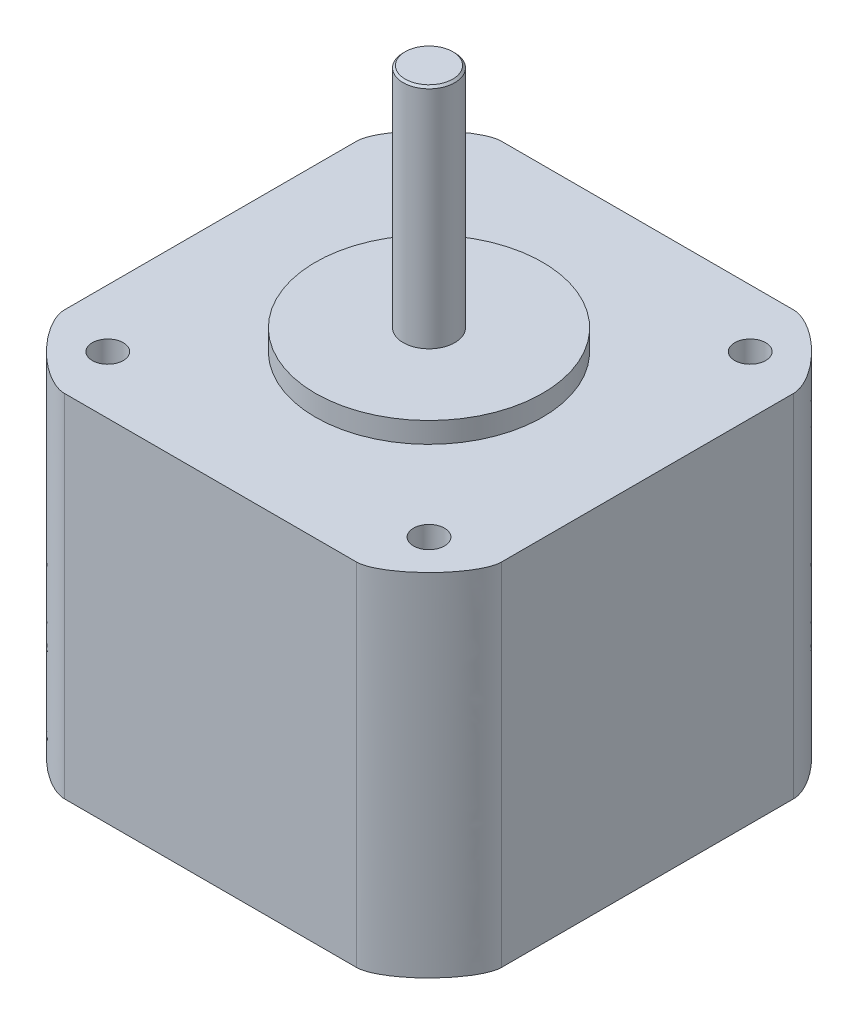
ISO-10303-21;
HEADER;
FILE_DESCRIPTION(('STEP AP214'),'2;1');
FILE_NAME('part.step','',(''),(''),'','','');
FILE_SCHEMA(('AUTOMOTIVE_DESIGN { 1 0 10303 214 1 1 1 1 }'));
ENDSEC;
DATA;
#1=APPLICATION_CONTEXT('core data for automotive mechanical design processes');
#2=APPLICATION_PROTOCOL_DEFINITION('international standard','automotive_design',2000,#1);
#3=PRODUCT_CONTEXT('',#1,'mechanical');
#4=PRODUCT('Part','Part','',(#3));
#5=PRODUCT_RELATED_PRODUCT_CATEGORY('part','',(#4));
#6=PRODUCT_DEFINITION_FORMATION('','',#4);
#7=PRODUCT_DEFINITION_CONTEXT('part definition',#1,'design');
#8=PRODUCT_DEFINITION('design','',#6,#7);
#9=PRODUCT_DEFINITION_SHAPE('','',#8);
#10=(LENGTH_UNIT() NAMED_UNIT(*) SI_UNIT(.MILLI.,.METRE.));
#11=(NAMED_UNIT(*) PLANE_ANGLE_UNIT() SI_UNIT($,.RADIAN.));
#12=(NAMED_UNIT(*) SI_UNIT($,.STERADIAN.) SOLID_ANGLE_UNIT());
#13=UNCERTAINTY_MEASURE_WITH_UNIT(LENGTH_MEASURE(1.E-05),#10,'distance_accuracy_value','');
#14=(GEOMETRIC_REPRESENTATION_CONTEXT(3) GLOBAL_UNCERTAINTY_ASSIGNED_CONTEXT((#13)) GLOBAL_UNIT_ASSIGNED_CONTEXT((#10,
#11,#12)) REPRESENTATION_CONTEXT('',''));
#15=CARTESIAN_POINT('',(0.,0.,0.));
#16=DIRECTION('',(0.,0.,1.));
#17=DIRECTION('',(1.,0.,0.));
#18=AXIS2_PLACEMENT_3D('',#15,#16,#17);
#19=CARTESIAN_POINT('',(0.,0.,0.));
#20=DIRECTION('',(0.,1.,0.));
#21=DIRECTION('',(0.,0.,1.));
#22=AXIS2_PLACEMENT_3D('',#19,#20,#21);
#23=PLANE('',#22);
#24=CARTESIAN_POINT('',(15.55,0.,15.55));
#25=DIRECTION('',(0.,1.,0.));
#26=DIRECTION('',(0.,0.,1.));
#27=AXIS2_PLACEMENT_3D('',#24,#25,#26);
#28=CIRCLE('',#27,1.5);
#29=CARTESIAN_POINT('',(15.55,0.,17.05));
#30=VERTEX_POINT('',#29);
#31=EDGE_CURVE('E704',#30,#30,#28,.T.);
#32=ORIENTED_EDGE('',*,*,#31,.F.);
#33=EDGE_LOOP('',(#32));
#34=FACE_BOUND('',#33,.T.);
#35=CARTESIAN_POINT('',(15.55,0.,-15.55));
#36=DIRECTION('',(0.,1.,0.));
#37=DIRECTION('',(0.,0.,1.));
#38=AXIS2_PLACEMENT_3D('',#35,#36,#37);
#39=CIRCLE('',#38,1.5);
#40=CARTESIAN_POINT('',(15.55,0.,-14.05));
#41=VERTEX_POINT('',#40);
#42=EDGE_CURVE('E709',#41,#41,#39,.T.);
#43=ORIENTED_EDGE('',*,*,#42,.F.);
#44=EDGE_LOOP('',(#43));
#45=FACE_BOUND('',#44,.T.);
#46=CARTESIAN_POINT('',(-15.55,0.,-15.55));
#47=DIRECTION('',(0.,1.,0.));
#48=DIRECTION('',(0.,0.,1.));
#49=AXIS2_PLACEMENT_3D('',#46,#47,#48);
#50=CIRCLE('',#49,1.5);
#51=CARTESIAN_POINT('',(-15.55,0.,-14.05));
#52=VERTEX_POINT('',#51);
#53=EDGE_CURVE('E715',#52,#52,#50,.T.);
#54=ORIENTED_EDGE('',*,*,#53,.F.);
#55=EDGE_LOOP('',(#54));
#56=FACE_BOUND('',#55,.T.);
#57=CARTESIAN_POINT('',(-15.55,0.,15.55));
#58=DIRECTION('',(0.,1.,0.));
#59=DIRECTION('',(0.,0.,1.));
#60=AXIS2_PLACEMENT_3D('',#57,#58,#59);
#61=CIRCLE('',#60,1.5);
#62=CARTESIAN_POINT('',(-15.55,0.,17.05));
#63=VERTEX_POINT('',#62);
#64=EDGE_CURVE('E721',#63,#63,#61,.T.);
#65=ORIENTED_EDGE('',*,*,#64,.F.);
#66=EDGE_LOOP('',(#65));
#67=FACE_BOUND('',#66,.T.);
#68=DIRECTION('',(1.,0.,0.));
#69=VECTOR('',#68,1.);
#70=CARTESIAN_POINT('',(0.,0.,21.15));
#71=LINE('',#70,#69);
#72=CARTESIAN_POINT('',(-14.15,0.,21.15));
#73=VERTEX_POINT('',#72);
#74=CARTESIAN_POINT('',(14.15,0.,21.15));
#75=VERTEX_POINT('',#74);
#76=EDGE_CURVE('E127',#73,#75,#71,.T.);
#77=ORIENTED_EDGE('',*,*,#76,.T.);
#78=CARTESIAN_POINT('',(21.15,0.,14.15));
#79=CARTESIAN_POINT('',(21.15,0.,21.15));
#80=CARTESIAN_POINT('',(14.15,0.,21.15));
#81=(BOUNDED_CURVE() B_SPLINE_CURVE(2,(#78,#79,#80),.UNSPECIFIED.,.F.,
.F.) B_SPLINE_CURVE_WITH_KNOTS((3,3),(0.,1.),
.UNSPECIFIED.) CURVE() GEOMETRIC_REPRESENTATION_ITEM() RATIONAL_B_SPLINE_CURVE((1.,
0.333333333333333,1.)) REPRESENTATION_ITEM(''));
#82=CARTESIAN_POINT('',(21.15,0.,14.15));
#83=VERTEX_POINT('',#82);
#84=EDGE_CURVE('E235',#75,#83,#81,.F.);
#85=ORIENTED_EDGE('',*,*,#84,.T.);
#86=DIRECTION('',(0.,0.,-1.));
#87=VECTOR('',#86,1.);
#88=CARTESIAN_POINT('',(21.15,0.,0.));
#89=LINE('',#88,#87);
#90=CARTESIAN_POINT('',(21.15,0.,-14.15));
#91=VERTEX_POINT('',#90);
#92=EDGE_CURVE('E149',#83,#91,#89,.T.);
#93=ORIENTED_EDGE('',*,*,#92,.T.);
#94=CARTESIAN_POINT('',(14.15,0.,-21.15));
#95=CARTESIAN_POINT('',(21.15,0.,-21.15));
#96=CARTESIAN_POINT('',(21.15,0.,-14.15));
#97=(BOUNDED_CURVE() B_SPLINE_CURVE(2,(#94,#95,#96),.UNSPECIFIED.,.F.,
.F.) B_SPLINE_CURVE_WITH_KNOTS((3,3),(0.,1.),
.UNSPECIFIED.) CURVE() GEOMETRIC_REPRESENTATION_ITEM() RATIONAL_B_SPLINE_CURVE((1.,
0.333333333333333,1.)) REPRESENTATION_ITEM(''));
#98=CARTESIAN_POINT('',(14.15,0.,-21.15));
#99=VERTEX_POINT('',#98);
#100=EDGE_CURVE('E135',#91,#99,#97,.F.);
#101=ORIENTED_EDGE('',*,*,#100,.T.);
#102=DIRECTION('',(1.,0.,0.));
#103=VECTOR('',#102,1.);
#104=CARTESIAN_POINT('',(0.,0.,-21.15));
#105=LINE('',#104,#103);
#106=CARTESIAN_POINT('',(-14.15,0.,-21.15));
#107=VERTEX_POINT('',#106);
#108=EDGE_CURVE('E241',#107,#99,#105,.T.);
#109=ORIENTED_EDGE('',*,*,#108,.F.);
#110=CARTESIAN_POINT('',(-21.15,0.,-14.15));
#111=CARTESIAN_POINT('',(-21.15,0.,-21.15));
#112=CARTESIAN_POINT('',(-14.15,0.,-21.15));
#113=(BOUNDED_CURVE() B_SPLINE_CURVE(2,(#110,#111,#112),.UNSPECIFIED.,.F.,
.F.) B_SPLINE_CURVE_WITH_KNOTS((3,3),(0.,1.),
.UNSPECIFIED.) CURVE() GEOMETRIC_REPRESENTATION_ITEM() RATIONAL_B_SPLINE_CURVE((1.,
0.333333333333333,1.)) REPRESENTATION_ITEM(''));
#114=CARTESIAN_POINT('',(-21.15,0.,-14.15));
#115=VERTEX_POINT('',#114);
#116=EDGE_CURVE('E136',#107,#115,#113,.F.);
#117=ORIENTED_EDGE('',*,*,#116,.T.);
#118=DIRECTION('',(0.,0.,-1.));
#119=VECTOR('',#118,1.);
#120=CARTESIAN_POINT('',(-21.15,0.,0.));
#121=LINE('',#120,#119);
#122=CARTESIAN_POINT('',(-21.15,0.,14.15));
#123=VERTEX_POINT('',#122);
#124=EDGE_CURVE('E129',#123,#115,#121,.T.);
#125=ORIENTED_EDGE('',*,*,#124,.F.);
#126=CARTESIAN_POINT('',(-14.15,0.,21.15));
#127=CARTESIAN_POINT('',(-21.15,0.,21.15));
#128=CARTESIAN_POINT('',(-21.15,0.,14.15));
#129=(BOUNDED_CURVE() B_SPLINE_CURVE(2,(#126,#127,#128),.UNSPECIFIED.,.F.,
.F.) B_SPLINE_CURVE_WITH_KNOTS((3,3),(0.,1.),
.UNSPECIFIED.) CURVE() GEOMETRIC_REPRESENTATION_ITEM() RATIONAL_B_SPLINE_CURVE((1.,
0.333333333333333,1.)) REPRESENTATION_ITEM(''));
#130=EDGE_CURVE('E123',#123,#73,#129,.F.);
#131=ORIENTED_EDGE('',*,*,#130,.T.);
#132=EDGE_LOOP('',(#77,#85,#93,#101,#109,#117,#125,#131));
#133=FACE_BOUND('',#132,.T.);
#134=CARTESIAN_POINT('',(0.,0.,0.));
#135=DIRECTION('',(0.,1.,0.));
#136=DIRECTION('',(0.,0.,1.));
#137=AXIS2_PLACEMENT_3D('',#134,#135,#136);
#138=CIRCLE('',#137,11.);
#139=CARTESIAN_POINT('',(0.,0.,11.));
#140=VERTEX_POINT('',#139);
#141=EDGE_CURVE('E697',#140,#140,#138,.T.);
#142=ORIENTED_EDGE('',*,*,#141,.F.);
#143=EDGE_LOOP('',(#142));
#144=FACE_BOUND('',#143,.T.);
#145=ADVANCED_FACE('F55',(#34,#45,#56,#67,#133,#144),#23,.T.);
#146=CARTESIAN_POINT('',(0.,-34.,21.15));
#147=DIRECTION('',(0.,0.,1.));
#148=DIRECTION('',(1.,0.,0.));
#149=AXIS2_PLACEMENT_3D('',#146,#147,#148);
#150=PLANE('',#149);
#151=DIRECTION('',(1.,0.,0.));
#152=VECTOR('',#151,1.);
#153=CARTESIAN_POINT('',(0.,-34.,21.15));
#154=LINE('',#153,#152);
#155=CARTESIAN_POINT('',(-14.15,-34.,21.15));
#156=VERTEX_POINT('',#155);
#157=CARTESIAN_POINT('',(14.15,-34.,21.15));
#158=VERTEX_POINT('',#157);
#159=EDGE_CURVE('E330',#156,#158,#154,.T.);
#160=ORIENTED_EDGE('',*,*,#159,.T.);
#161=CARTESIAN_POINT('',(14.15,1.69999999999999,21.15));
#162=CARTESIAN_POINT('',(14.15,-10.7666666666667,21.15));
#163=CARTESIAN_POINT('',(14.15,-23.2333333333333,21.15));
#164=CARTESIAN_POINT('',(14.15,-35.7,21.15));
#165=(BOUNDED_CURVE() B_SPLINE_CURVE(3,(#161,#162,#163,#164),.UNSPECIFIED.,.F.,
.F.) B_SPLINE_CURVE_WITH_KNOTS((4,4),(-0.0017,0.0357),
.UNSPECIFIED.) CURVE() GEOMETRIC_REPRESENTATION_ITEM() RATIONAL_B_SPLINE_CURVE((1.,1.,1.,1.)) REPRESENTATION_ITEM(''));
#166=EDGE_CURVE('E147',#158,#75,#165,.F.);
#167=ORIENTED_EDGE('',*,*,#166,.T.);
#168=ORIENTED_EDGE('',*,*,#76,.F.);
#169=CARTESIAN_POINT('',(-14.15,-35.7,21.15));
#170=CARTESIAN_POINT('',(-14.15,-23.2333333333333,21.15));
#171=CARTESIAN_POINT('',(-14.15,-10.7666666666666,21.15));
#172=CARTESIAN_POINT('',(-14.15,1.7,21.15));
#173=(BOUNDED_CURVE() B_SPLINE_CURVE(3,(#169,#170,#171,#172),.UNSPECIFIED.,.F.,
.F.) B_SPLINE_CURVE_WITH_KNOTS((4,4),(-0.0357,0.0017),
.UNSPECIFIED.) CURVE() GEOMETRIC_REPRESENTATION_ITEM() RATIONAL_B_SPLINE_CURVE((1.,1.,1.,1.)) REPRESENTATION_ITEM(''));
#174=EDGE_CURVE('E143',#73,#156,#173,.F.);
#175=ORIENTED_EDGE('',*,*,#174,.T.);
#176=EDGE_LOOP('',(#160,#167,#168,#175));
#177=FACE_BOUND('',#176,.T.);
#178=ADVANCED_FACE('F142',(#177),#150,.T.);
#179=CARTESIAN_POINT('',(-21.15,-34.,0.));
#180=DIRECTION('',(1.,0.,0.));
#181=DIRECTION('',(0.,0.,-1.));
#182=AXIS2_PLACEMENT_3D('',#179,#180,#181);
#183=PLANE('',#182);
#184=DIRECTION('',(0.,0.,-1.));
#185=VECTOR('',#184,1.);
#186=CARTESIAN_POINT('',(-21.15,-34.,0.));
#187=LINE('',#186,#185);
#188=CARTESIAN_POINT('',(-21.15,-34.,14.15));
#189=VERTEX_POINT('',#188);
#190=CARTESIAN_POINT('',(-21.15,-34.,-14.15));
#191=VERTEX_POINT('',#190);
#192=EDGE_CURVE('E157',#189,#191,#187,.T.);
#193=ORIENTED_EDGE('',*,*,#192,.F.);
#194=CARTESIAN_POINT('',(-21.15,1.7,14.15));
#195=CARTESIAN_POINT('',(-21.15,-10.7666666666666,14.15));
#196=CARTESIAN_POINT('',(-21.15,-23.2333333333333,14.15));
#197=CARTESIAN_POINT('',(-21.15,-35.7,14.15));
#198=(BOUNDED_CURVE() B_SPLINE_CURVE(3,(#194,#195,#196,#197),.UNSPECIFIED.,.F.,
.F.) B_SPLINE_CURVE_WITH_KNOTS((4,4),(-0.0357,0.0017),
.UNSPECIFIED.) CURVE() GEOMETRIC_REPRESENTATION_ITEM() RATIONAL_B_SPLINE_CURVE((1.,1.,1.,1.)) REPRESENTATION_ITEM(''));
#199=EDGE_CURVE('E206',#189,#123,#198,.F.);
#200=ORIENTED_EDGE('',*,*,#199,.T.);
#201=ORIENTED_EDGE('',*,*,#124,.T.);
#202=CARTESIAN_POINT('',(-21.15,-35.7,-14.15));
#203=CARTESIAN_POINT('',(-21.15,-23.2333333333333,-14.15));
#204=CARTESIAN_POINT('',(-21.15,-10.7666666666667,-14.15));
#205=CARTESIAN_POINT('',(-21.15,1.69999999999999,-14.15));
#206=(BOUNDED_CURVE() B_SPLINE_CURVE(3,(#202,#203,#204,#205),.UNSPECIFIED.,.F.,
.F.) B_SPLINE_CURVE_WITH_KNOTS((4,4),(-0.0017,0.0357),
.UNSPECIFIED.) CURVE() GEOMETRIC_REPRESENTATION_ITEM() RATIONAL_B_SPLINE_CURVE((1.,1.,1.,1.)) REPRESENTATION_ITEM(''));
#207=EDGE_CURVE('E210',#115,#191,#206,.F.);
#208=ORIENTED_EDGE('',*,*,#207,.T.);
#209=EDGE_LOOP('',(#193,#200,#201,#208));
#210=FACE_BOUND('',#209,.T.);
#211=ADVANCED_FACE('F329',(#210),#183,.F.);
#212=CARTESIAN_POINT('',(0.,-34.,-21.15));
#213=DIRECTION('',(0.,0.,1.));
#214=DIRECTION('',(1.,0.,0.));
#215=AXIS2_PLACEMENT_3D('',#212,#213,#214);
#216=PLANE('',#215);
#217=ORIENTED_EDGE('',*,*,#108,.T.);
#218=CARTESIAN_POINT('',(14.15,-35.7,-21.15));
#219=CARTESIAN_POINT('',(14.15,-23.2333333333333,-21.15));
#220=CARTESIAN_POINT('',(14.15,-10.7666666666666,-21.15));
#221=CARTESIAN_POINT('',(14.15,1.7,-21.15));
#222=(BOUNDED_CURVE() B_SPLINE_CURVE(3,(#218,#219,#220,#221),.UNSPECIFIED.,.F.,
.F.) B_SPLINE_CURVE_WITH_KNOTS((4,4),(-0.0357,0.0017),
.UNSPECIFIED.) CURVE() GEOMETRIC_REPRESENTATION_ITEM() RATIONAL_B_SPLINE_CURVE((1.,1.,1.,1.)) REPRESENTATION_ITEM(''));
#223=CARTESIAN_POINT('',(14.15,-34.,-21.15));
#224=VERTEX_POINT('',#223);
#225=EDGE_CURVE('E69',#99,#224,#222,.F.);
#226=ORIENTED_EDGE('',*,*,#225,.T.);
#227=DIRECTION('',(1.,0.,0.));
#228=VECTOR('',#227,1.);
#229=CARTESIAN_POINT('',(0.,-34.,-21.15));
#230=LINE('',#229,#228);
#231=CARTESIAN_POINT('',(-14.15,-34.,-21.15));
#232=VERTEX_POINT('',#231);
#233=EDGE_CURVE('E412',#232,#224,#230,.T.);
#234=ORIENTED_EDGE('',*,*,#233,.F.);
#235=CARTESIAN_POINT('',(-14.15,1.69999999999999,-21.15));
#236=CARTESIAN_POINT('',(-14.15,-10.7666666666667,-21.15));
#237=CARTESIAN_POINT('',(-14.15,-23.2333333333333,-21.15));
#238=CARTESIAN_POINT('',(-14.15,-35.7,-21.15));
#239=(BOUNDED_CURVE() B_SPLINE_CURVE(3,(#235,#236,#237,#238),.UNSPECIFIED.,.F.,
.F.) B_SPLINE_CURVE_WITH_KNOTS((4,4),(-0.0017,0.0357),
.UNSPECIFIED.) CURVE() GEOMETRIC_REPRESENTATION_ITEM() RATIONAL_B_SPLINE_CURVE((1.,1.,1.,1.)) REPRESENTATION_ITEM(''));
#240=EDGE_CURVE('E214',#232,#107,#239,.F.);
#241=ORIENTED_EDGE('',*,*,#240,.T.);
#242=EDGE_LOOP('',(#217,#226,#234,#241));
#243=FACE_BOUND('',#242,.T.);
#244=ADVANCED_FACE('F245',(#243),#216,.F.);
#245=CARTESIAN_POINT('',(21.15,-34.,0.));
#246=DIRECTION('',(1.,0.,0.));
#247=DIRECTION('',(0.,0.,-1.));
#248=AXIS2_PLACEMENT_3D('',#245,#246,#247);
#249=PLANE('',#248);
#250=ORIENTED_EDGE('',*,*,#92,.F.);
#251=CARTESIAN_POINT('',(21.15,-35.7,14.15));
#252=CARTESIAN_POINT('',(21.15,-23.2333333333333,14.15));
#253=CARTESIAN_POINT('',(21.15,-10.7666666666667,14.15));
#254=CARTESIAN_POINT('',(21.15,1.69999999999999,14.15));
#255=(BOUNDED_CURVE() B_SPLINE_CURVE(3,(#251,#252,#253,#254),.UNSPECIFIED.,.F.,
.F.) B_SPLINE_CURVE_WITH_KNOTS((4,4),(-0.0017,0.0357),
.UNSPECIFIED.) CURVE() GEOMETRIC_REPRESENTATION_ITEM() RATIONAL_B_SPLINE_CURVE((1.,1.,1.,1.)) REPRESENTATION_ITEM(''));
#256=CARTESIAN_POINT('',(21.15,-34.,14.15));
#257=VERTEX_POINT('',#256);
#258=EDGE_CURVE('E228',#83,#257,#255,.F.);
#259=ORIENTED_EDGE('',*,*,#258,.T.);
#260=DIRECTION('',(0.,0.,-1.));
#261=VECTOR('',#260,1.);
#262=CARTESIAN_POINT('',(21.15,-34.,0.));
#263=LINE('',#262,#261);
#264=CARTESIAN_POINT('',(21.15,-34.,-14.15));
#265=VERTEX_POINT('',#264);
#266=EDGE_CURVE('E405',#257,#265,#263,.T.);
#267=ORIENTED_EDGE('',*,*,#266,.T.);
#268=CARTESIAN_POINT('',(21.15,1.7,-14.15));
#269=CARTESIAN_POINT('',(21.15,-10.7666666666666,-14.15));
#270=CARTESIAN_POINT('',(21.15,-23.2333333333333,-14.15));
#271=CARTESIAN_POINT('',(21.15,-35.7,-14.15));
#272=(BOUNDED_CURVE() B_SPLINE_CURVE(3,(#268,#269,#270,#271),.UNSPECIFIED.,.F.,
.F.) B_SPLINE_CURVE_WITH_KNOTS((4,4),(-0.0357,0.0017),
.UNSPECIFIED.) CURVE() GEOMETRIC_REPRESENTATION_ITEM() RATIONAL_B_SPLINE_CURVE((1.,1.,1.,1.)) REPRESENTATION_ITEM(''));
#273=EDGE_CURVE('E229',#265,#91,#272,.F.);
#274=ORIENTED_EDGE('',*,*,#273,.T.);
#275=EDGE_LOOP('',(#250,#259,#267,#274));
#276=FACE_BOUND('',#275,.T.);
#277=ADVANCED_FACE('F469',(#276),#249,.T.);
#278=CARTESIAN_POINT('',(0.,-34.,0.));
#279=DIRECTION('',(0.,1.,0.));
#280=DIRECTION('',(0.,0.,1.));
#281=AXIS2_PLACEMENT_3D('',#278,#279,#280);
#282=PLANE('',#281);
#283=ORIENTED_EDGE('',*,*,#266,.F.);
#284=CARTESIAN_POINT('',(14.15,-34.,21.15));
#285=CARTESIAN_POINT('',(21.15,-34.,21.15));
#286=CARTESIAN_POINT('',(21.15,-34.,14.15));
#287=(BOUNDED_CURVE() B_SPLINE_CURVE(2,(#284,#285,#286),.UNSPECIFIED.,.F.,
.F.) B_SPLINE_CURVE_WITH_KNOTS((3,3),(0.,1.),
.UNSPECIFIED.) CURVE() GEOMETRIC_REPRESENTATION_ITEM() RATIONAL_B_SPLINE_CURVE((1.,
0.333333333333333,1.)) REPRESENTATION_ITEM(''));
#288=EDGE_CURVE('E216',#257,#158,#287,.F.);
#289=ORIENTED_EDGE('',*,*,#288,.T.);
#290=ORIENTED_EDGE('',*,*,#159,.F.);
#291=CARTESIAN_POINT('',(-21.15,-34.,14.15));
#292=CARTESIAN_POINT('',(-21.15,-34.,21.15));
#293=CARTESIAN_POINT('',(-14.15,-34.,21.15));
#294=(BOUNDED_CURVE() B_SPLINE_CURVE(2,(#291,#292,#293),.UNSPECIFIED.,.F.,
.F.) B_SPLINE_CURVE_WITH_KNOTS((3,3),(0.,1.),
.UNSPECIFIED.) CURVE() GEOMETRIC_REPRESENTATION_ITEM() RATIONAL_B_SPLINE_CURVE((1.,
0.333333333333333,1.)) REPRESENTATION_ITEM(''));
#295=EDGE_CURVE('E155',#156,#189,#294,.F.);
#296=ORIENTED_EDGE('',*,*,#295,.T.);
#297=ORIENTED_EDGE('',*,*,#192,.T.);
#298=CARTESIAN_POINT('',(-14.15,-34.,-21.15));
#299=CARTESIAN_POINT('',(-21.15,-34.,-21.15));
#300=CARTESIAN_POINT('',(-21.15,-34.,-14.15));
#301=(BOUNDED_CURVE() B_SPLINE_CURVE(2,(#298,#299,#300),.UNSPECIFIED.,.F.,
.F.) B_SPLINE_CURVE_WITH_KNOTS((3,3),(0.,1.),
.UNSPECIFIED.) CURVE() GEOMETRIC_REPRESENTATION_ITEM() RATIONAL_B_SPLINE_CURVE((1.,
0.333333333333333,1.)) REPRESENTATION_ITEM(''));
#302=EDGE_CURVE('E77',#191,#232,#301,.F.);
#303=ORIENTED_EDGE('',*,*,#302,.T.);
#304=ORIENTED_EDGE('',*,*,#233,.T.);
#305=CARTESIAN_POINT('',(21.15,-34.,-14.15));
#306=CARTESIAN_POINT('',(21.15,-34.,-21.15));
#307=CARTESIAN_POINT('',(14.15,-34.,-21.15));
#308=(BOUNDED_CURVE() B_SPLINE_CURVE(2,(#305,#306,#307),.UNSPECIFIED.,.F.,
.F.) B_SPLINE_CURVE_WITH_KNOTS((3,3),(0.,1.),
.UNSPECIFIED.) CURVE() GEOMETRIC_REPRESENTATION_ITEM() RATIONAL_B_SPLINE_CURVE((1.,
0.333333333333333,1.)) REPRESENTATION_ITEM(''));
#309=EDGE_CURVE('E220',#224,#265,#308,.F.);
#310=ORIENTED_EDGE('',*,*,#309,.T.);
#311=EDGE_LOOP('',(#283,#289,#290,#296,#297,#303,#304,#310));
#312=FACE_BOUND('',#311,.T.);
#313=ADVANCED_FACE('F298',(#312),#282,.F.);
#314=CARTESIAN_POINT('',(14.15,-35.7,21.15));
#315=CARTESIAN_POINT('',(14.15,-23.2333333333333,21.15));
#316=CARTESIAN_POINT('',(14.15,-10.7666666666667,21.15));
#317=CARTESIAN_POINT('',(14.15,1.69999999999999,21.15));
#318=CARTESIAN_POINT('',(21.15,-35.7,21.15));
#319=CARTESIAN_POINT('',(21.15,-23.2333333333333,21.15));
#320=CARTESIAN_POINT('',(21.15,-10.7666666666667,21.15));
#321=CARTESIAN_POINT('',(21.15,1.69999999999999,21.15));
#322=CARTESIAN_POINT('',(21.15,-35.7,14.15));
#323=CARTESIAN_POINT('',(21.15,-23.2333333333333,14.15));
#324=CARTESIAN_POINT('',(21.15,-10.7666666666667,14.15));
#325=CARTESIAN_POINT('',(21.15,1.69999999999999,14.15));
#326=(BOUNDED_SURFACE() B_SPLINE_SURFACE(2,3,((#314,#315,#316,#317),(#318,#319,#320,#321),(#322,
#323,#324,#325)),.UNSPECIFIED.,.F.,.F.,.F.) B_SPLINE_SURFACE_WITH_KNOTS((3,3),(4,4),(0.,1.),
(-0.0017,0.0357),.UNSPECIFIED.) GEOMETRIC_REPRESENTATION_ITEM() RATIONAL_B_SPLINE_SURFACE(((1.,
1.,1.,1.),(0.333333333333333,0.333333333333333,0.333333333333333,0.333333333333333),(1.,1.,1.,1.))) REPRESENTATION_ITEM('') SURFACE());
#327=ORIENTED_EDGE('',*,*,#288,.F.);
#328=ORIENTED_EDGE('',*,*,#258,.F.);
#329=ORIENTED_EDGE('',*,*,#84,.F.);
#330=ORIENTED_EDGE('',*,*,#166,.F.);
#331=EDGE_LOOP('',(#327,#328,#329,#330));
#332=FACE_BOUND('',#331,.T.);
#333=ADVANCED_FACE('F287',(#332),#326,.T.);
#334=CARTESIAN_POINT('',(14.15,1.7,-21.15));
#335=CARTESIAN_POINT('',(14.15,-10.7666666666666,-21.15));
#336=CARTESIAN_POINT('',(14.15,-23.2333333333333,-21.15));
#337=CARTESIAN_POINT('',(14.15,-35.7,-21.15));
#338=CARTESIAN_POINT('',(21.15,1.7,-21.15));
#339=CARTESIAN_POINT('',(21.15,-10.7666666666666,-21.15));
#340=CARTESIAN_POINT('',(21.15,-23.2333333333333,-21.15));
#341=CARTESIAN_POINT('',(21.15,-35.7,-21.15));
#342=CARTESIAN_POINT('',(21.15,1.7,-14.15));
#343=CARTESIAN_POINT('',(21.15,-10.7666666666666,-14.15));
#344=CARTESIAN_POINT('',(21.15,-23.2333333333333,-14.15));
#345=CARTESIAN_POINT('',(21.15,-35.7,-14.15));
#346=(BOUNDED_SURFACE() B_SPLINE_SURFACE(2,3,((#334,#335,#336,#337),(#338,#339,#340,#341),(#342,
#343,#344,#345)),.UNSPECIFIED.,.F.,.F.,.F.) B_SPLINE_SURFACE_WITH_KNOTS((3,3),(4,4),(0.,1.),
(-0.0357,0.0017),.UNSPECIFIED.) GEOMETRIC_REPRESENTATION_ITEM() RATIONAL_B_SPLINE_SURFACE(((1.,
1.,1.,1.),(0.333333333333333,0.333333333333333,0.333333333333333,0.333333333333333),(1.,1.,1.,1.))) REPRESENTATION_ITEM('') SURFACE());
#347=ORIENTED_EDGE('',*,*,#309,.F.);
#348=ORIENTED_EDGE('',*,*,#225,.F.);
#349=ORIENTED_EDGE('',*,*,#100,.F.);
#350=ORIENTED_EDGE('',*,*,#273,.F.);
#351=EDGE_LOOP('',(#347,#348,#349,#350));
#352=FACE_BOUND('',#351,.T.);
#353=ADVANCED_FACE('F178',(#352),#346,.T.);
#354=CARTESIAN_POINT('',(-14.15,1.7,21.15));
#355=CARTESIAN_POINT('',(-14.15,-10.7666666666666,21.15));
#356=CARTESIAN_POINT('',(-14.15,-23.2333333333333,21.15));
#357=CARTESIAN_POINT('',(-14.15,-35.7,21.15));
#358=CARTESIAN_POINT('',(-21.15,1.7,21.15));
#359=CARTESIAN_POINT('',(-21.15,-10.7666666666666,21.15));
#360=CARTESIAN_POINT('',(-21.15,-23.2333333333333,21.15));
#361=CARTESIAN_POINT('',(-21.15,-35.7,21.15));
#362=CARTESIAN_POINT('',(-21.15,1.7,14.15));
#363=CARTESIAN_POINT('',(-21.15,-10.7666666666666,14.15));
#364=CARTESIAN_POINT('',(-21.15,-23.2333333333333,14.15));
#365=CARTESIAN_POINT('',(-21.15,-35.7,14.15));
#366=(BOUNDED_SURFACE() B_SPLINE_SURFACE(2,3,((#354,#355,#356,#357),(#358,#359,#360,#361),(#362,
#363,#364,#365)),.UNSPECIFIED.,.F.,.F.,.F.) B_SPLINE_SURFACE_WITH_KNOTS((3,3),(4,4),(0.,1.),
(-0.0357,0.0017),.UNSPECIFIED.) GEOMETRIC_REPRESENTATION_ITEM() RATIONAL_B_SPLINE_SURFACE(((1.,
1.,1.,1.),(0.333333333333333,0.333333333333333,0.333333333333333,0.333333333333333),(1.,1.,1.,1.))) REPRESENTATION_ITEM('') SURFACE());
#367=ORIENTED_EDGE('',*,*,#295,.F.);
#368=ORIENTED_EDGE('',*,*,#174,.F.);
#369=ORIENTED_EDGE('',*,*,#130,.F.);
#370=ORIENTED_EDGE('',*,*,#199,.F.);
#371=EDGE_LOOP('',(#367,#368,#369,#370));
#372=FACE_BOUND('',#371,.T.);
#373=ADVANCED_FACE('F154',(#372),#366,.T.);
#374=CARTESIAN_POINT('',(-14.15,-35.7,-21.15));
#375=CARTESIAN_POINT('',(-14.15,-23.2333333333333,-21.15));
#376=CARTESIAN_POINT('',(-14.15,-10.7666666666667,-21.15));
#377=CARTESIAN_POINT('',(-14.15,1.69999999999999,-21.15));
#378=CARTESIAN_POINT('',(-21.15,-35.7,-21.15));
#379=CARTESIAN_POINT('',(-21.15,-23.2333333333333,-21.15));
#380=CARTESIAN_POINT('',(-21.15,-10.7666666666667,-21.15));
#381=CARTESIAN_POINT('',(-21.15,1.69999999999999,-21.15));
#382=CARTESIAN_POINT('',(-21.15,-35.7,-14.15));
#383=CARTESIAN_POINT('',(-21.15,-23.2333333333333,-14.15));
#384=CARTESIAN_POINT('',(-21.15,-10.7666666666667,-14.15));
#385=CARTESIAN_POINT('',(-21.15,1.69999999999999,-14.15));
#386=(BOUNDED_SURFACE() B_SPLINE_SURFACE(2,3,((#374,#375,#376,#377),(#378,#379,#380,#381),(#382,
#383,#384,#385)),.UNSPECIFIED.,.F.,.F.,.F.) B_SPLINE_SURFACE_WITH_KNOTS((3,3),(4,4),(0.,1.),
(-0.0017,0.0357),.UNSPECIFIED.) GEOMETRIC_REPRESENTATION_ITEM() RATIONAL_B_SPLINE_SURFACE(((1.,
1.,1.,1.),(0.333333333333333,0.333333333333333,0.333333333333333,0.333333333333333),(1.,1.,1.,1.))) REPRESENTATION_ITEM('') SURFACE());
#387=ORIENTED_EDGE('',*,*,#302,.F.);
#388=ORIENTED_EDGE('',*,*,#207,.F.);
#389=ORIENTED_EDGE('',*,*,#116,.F.);
#390=ORIENTED_EDGE('',*,*,#240,.F.);
#391=EDGE_LOOP('',(#387,#388,#389,#390));
#392=FACE_BOUND('',#391,.T.);
#393=ADVANCED_FACE('F177',(#392),#386,.T.);
#394=CARTESIAN_POINT('',(-15.55,-3.99999999999999,15.55));
#395=DIRECTION('',(0.,1.,0.));
#396=DIRECTION('',(0.,0.,1.));
#397=AXIS2_PLACEMENT_3D('',#394,#395,#396);
#398=CYLINDRICAL_SURFACE('',#397,1.5);
#399=CARTESIAN_POINT('',(-15.55,-3.99999999999999,15.55));
#400=DIRECTION('',(0.,1.,0.));
#401=DIRECTION('',(0.,0.,1.));
#402=AXIS2_PLACEMENT_3D('',#399,#400,#401);
#403=CIRCLE('',#402,1.5);
#404=CARTESIAN_POINT('',(-15.55,-3.99999999999999,17.05));
#405=VERTEX_POINT('',#404);
#406=EDGE_CURVE('E150',#405,#405,#403,.T.);
#407=ORIENTED_EDGE('',*,*,#406,.F.);
#408=EDGE_LOOP('',(#407));
#409=FACE_BOUND('',#408,.T.);
#410=ORIENTED_EDGE('',*,*,#64,.T.);
#411=EDGE_LOOP('',(#410));
#412=FACE_BOUND('',#411,.T.);
#413=ADVANCED_FACE('F366',(#409,#412),#398,.F.);
#414=CARTESIAN_POINT('',(0.,-3.99999999999999,0.));
#415=DIRECTION('',(0.,1.,0.));
#416=DIRECTION('',(0.,0.,1.));
#417=AXIS2_PLACEMENT_3D('',#414,#415,#416);
#418=PLANE('',#417);
#419=ORIENTED_EDGE('',*,*,#406,.T.);
#420=EDGE_LOOP('',(#419));
#421=FACE_BOUND('',#420,.T.);
#422=ADVANCED_FACE('F370',(#421),#418,.T.);
#423=CARTESIAN_POINT('',(-15.55,-3.99999999999999,-15.55));
#424=DIRECTION('',(0.,1.,0.));
#425=DIRECTION('',(0.,0.,1.));
#426=AXIS2_PLACEMENT_3D('',#423,#424,#425);
#427=CYLINDRICAL_SURFACE('',#426,1.5);
#428=CARTESIAN_POINT('',(-15.55,-3.99999999999999,-15.55));
#429=DIRECTION('',(0.,1.,0.));
#430=DIRECTION('',(0.,0.,1.));
#431=AXIS2_PLACEMENT_3D('',#428,#429,#430);
#432=CIRCLE('',#431,1.5);
#433=CARTESIAN_POINT('',(-15.55,-3.99999999999999,-14.05));
#434=VERTEX_POINT('',#433);
#435=EDGE_CURVE('E718',#434,#434,#432,.T.);
#436=ORIENTED_EDGE('',*,*,#435,.F.);
#437=EDGE_LOOP('',(#436));
#438=FACE_BOUND('',#437,.T.);
#439=ORIENTED_EDGE('',*,*,#53,.T.);
#440=EDGE_LOOP('',(#439));
#441=FACE_BOUND('',#440,.T.);
#442=ADVANCED_FACE('F573',(#438,#441),#427,.F.);
#443=CARTESIAN_POINT('',(0.,-3.99999999999999,0.));
#444=DIRECTION('',(0.,1.,0.));
#445=DIRECTION('',(0.,0.,1.));
#446=AXIS2_PLACEMENT_3D('',#443,#444,#445);
#447=PLANE('',#446);
#448=ORIENTED_EDGE('',*,*,#435,.T.);
#449=EDGE_LOOP('',(#448));
#450=FACE_BOUND('',#449,.T.);
#451=ADVANCED_FACE('F583',(#450),#447,.T.);
#452=CARTESIAN_POINT('',(15.55,-3.99999999999999,-15.55));
#453=DIRECTION('',(0.,1.,0.));
#454=DIRECTION('',(0.,0.,1.));
#455=AXIS2_PLACEMENT_3D('',#452,#453,#454);
#456=CYLINDRICAL_SURFACE('',#455,1.5);
#457=CARTESIAN_POINT('',(15.55,-3.99999999999999,-15.55));
#458=DIRECTION('',(0.,1.,0.));
#459=DIRECTION('',(0.,0.,1.));
#460=AXIS2_PLACEMENT_3D('',#457,#458,#459);
#461=CIRCLE('',#460,1.5);
#462=CARTESIAN_POINT('',(15.55,-3.99999999999999,-14.05));
#463=VERTEX_POINT('',#462);
#464=EDGE_CURVE('E712',#463,#463,#461,.T.);
#465=ORIENTED_EDGE('',*,*,#464,.F.);
#466=EDGE_LOOP('',(#465));
#467=FACE_BOUND('',#466,.T.);
#468=ORIENTED_EDGE('',*,*,#42,.T.);
#469=EDGE_LOOP('',(#468));
#470=FACE_BOUND('',#469,.T.);
#471=ADVANCED_FACE('F593',(#467,#470),#456,.F.);
#472=CARTESIAN_POINT('',(0.,-3.99999999999999,0.));
#473=DIRECTION('',(0.,1.,0.));
#474=DIRECTION('',(0.,0.,1.));
#475=AXIS2_PLACEMENT_3D('',#472,#473,#474);
#476=PLANE('',#475);
#477=ORIENTED_EDGE('',*,*,#464,.T.);
#478=EDGE_LOOP('',(#477));
#479=FACE_BOUND('',#478,.T.);
#480=ADVANCED_FACE('F603',(#479),#476,.T.);
#481=CARTESIAN_POINT('',(15.55,-3.99999999999999,15.55));
#482=DIRECTION('',(0.,1.,0.));
#483=DIRECTION('',(0.,0.,1.));
#484=AXIS2_PLACEMENT_3D('',#481,#482,#483);
#485=CYLINDRICAL_SURFACE('',#484,1.5);
#486=CARTESIAN_POINT('',(15.55,-3.99999999999999,15.55));
#487=DIRECTION('',(0.,1.,0.));
#488=DIRECTION('',(0.,0.,1.));
#489=AXIS2_PLACEMENT_3D('',#486,#487,#488);
#490=CIRCLE('',#489,1.5);
#491=CARTESIAN_POINT('',(15.55,-3.99999999999999,17.05));
#492=VERTEX_POINT('',#491);
#493=EDGE_CURVE('E706',#492,#492,#490,.T.);
#494=ORIENTED_EDGE('',*,*,#493,.F.);
#495=EDGE_LOOP('',(#494));
#496=FACE_BOUND('',#495,.T.);
#497=ORIENTED_EDGE('',*,*,#31,.T.);
#498=EDGE_LOOP('',(#497));
#499=FACE_BOUND('',#498,.T.);
#500=ADVANCED_FACE('F613',(#496,#499),#485,.F.);
#501=CARTESIAN_POINT('',(0.,-3.99999999999999,0.));
#502=DIRECTION('',(0.,1.,0.));
#503=DIRECTION('',(0.,0.,1.));
#504=AXIS2_PLACEMENT_3D('',#501,#502,#503);
#505=PLANE('',#504);
#506=ORIENTED_EDGE('',*,*,#493,.T.);
#507=EDGE_LOOP('',(#506));
#508=FACE_BOUND('',#507,.T.);
#509=ADVANCED_FACE('F623',(#508),#505,.T.);
#510=CARTESIAN_POINT('',(0.,2.,0.));
#511=DIRECTION('',(0.,1.,0.));
#512=DIRECTION('',(0.,0.,1.));
#513=AXIS2_PLACEMENT_3D('',#510,#511,#512);
#514=PLANE('',#513);
#515=CARTESIAN_POINT('',(0.,2.,0.));
#516=DIRECTION('',(0.,1.,0.));
#517=DIRECTION('',(0.,0.,1.));
#518=AXIS2_PLACEMENT_3D('',#515,#516,#517);
#519=CIRCLE('',#518,11.);
#520=CARTESIAN_POINT('',(0.,2.,11.));
#521=VERTEX_POINT('',#520);
#522=EDGE_CURVE('E700',#521,#521,#519,.T.);
#523=ORIENTED_EDGE('',*,*,#522,.T.);
#524=EDGE_LOOP('',(#523));
#525=FACE_BOUND('',#524,.T.);
#526=CARTESIAN_POINT('',(0.,2.,0.));
#527=DIRECTION('',(0.,1.,0.));
#528=DIRECTION('',(0.,0.,1.));
#529=AXIS2_PLACEMENT_3D('',#526,#527,#528);
#530=CIRCLE('',#529,2.5);
#531=CARTESIAN_POINT('',(0.,2.,2.5));
#532=VERTEX_POINT('',#531);
#533=EDGE_CURVE('E695',#532,#532,#530,.T.);
#534=ORIENTED_EDGE('',*,*,#533,.F.);
#535=EDGE_LOOP('',(#534));
#536=FACE_BOUND('',#535,.T.);
#537=ADVANCED_FACE('F632',(#525,#536),#514,.T.);
#538=CARTESIAN_POINT('',(0.,2.,0.));
#539=DIRECTION('',(0.,-1.,0.));
#540=DIRECTION('',(0.,0.,-1.));
#541=AXIS2_PLACEMENT_3D('',#538,#539,#540);
#542=CYLINDRICAL_SURFACE('',#541,11.);
#543=ORIENTED_EDGE('',*,*,#522,.F.);
#544=EDGE_LOOP('',(#543));
#545=FACE_BOUND('',#544,.T.);
#546=ORIENTED_EDGE('',*,*,#141,.T.);
#547=EDGE_LOOP('',(#546));
#548=FACE_BOUND('',#547,.T.);
#549=ADVANCED_FACE('F647',(#545,#548),#542,.T.);
#550=CARTESIAN_POINT('',(0.,24.,0.));
#551=DIRECTION('',(0.,-1.,0.));
#552=DIRECTION('',(0.,0.,-1.));
#553=AXIS2_PLACEMENT_3D('',#550,#551,#552);
#554=CYLINDRICAL_SURFACE('',#553,2.5);
#555=CARTESIAN_POINT('',(0.,23.8,0.));
#556=DIRECTION('',(0.,1.,0.));
#557=DIRECTION('',(0.,0.,1.));
#558=AXIS2_PLACEMENT_3D('',#555,#556,#557);
#559=CIRCLE('',#558,2.5);
#560=CARTESIAN_POINT('',(0.,23.8,2.5));
#561=VERTEX_POINT('',#560);
#562=EDGE_CURVE('E13',#561,#561,#559,.F.);
#563=ORIENTED_EDGE('',*,*,#562,.T.);
#564=EDGE_LOOP('',(#563));
#565=FACE_BOUND('',#564,.T.);
#566=ORIENTED_EDGE('',*,*,#533,.T.);
#567=EDGE_LOOP('',(#566));
#568=FACE_BOUND('',#567,.T.);
#569=ADVANCED_FACE('F657',(#565,#568),#554,.T.);
#570=CARTESIAN_POINT('',(0.,24.,0.));
#571=DIRECTION('',(0.,1.,0.));
#572=DIRECTION('',(0.,0.,1.));
#573=AXIS2_PLACEMENT_3D('',#570,#571,#572);
#574=PLANE('',#573);
#575=CARTESIAN_POINT('',(0.,24.,0.));
#576=DIRECTION('',(0.,1.,0.));
#577=DIRECTION('',(0.,0.,1.));
#578=AXIS2_PLACEMENT_3D('',#575,#576,#577);
#579=CIRCLE('',#578,2.30000000000001);
#580=CARTESIAN_POINT('',(0.,24.,2.30000000000001));
#581=VERTEX_POINT('',#580);
#582=EDGE_CURVE('E62',#581,#581,#579,.T.);
#583=ORIENTED_EDGE('',*,*,#582,.T.);
#584=EDGE_LOOP('',(#583));
#585=FACE_BOUND('',#584,.T.);
#586=ADVANCED_FACE('F667',(#585),#574,.T.);
#587=CARTESIAN_POINT('',(0.,24.,0.));
#588=DIRECTION('',(0.,-1.,0.));
#589=DIRECTION('',(0.,0.,-1.));
#590=AXIS2_PLACEMENT_3D('',#587,#588,#589);
#591=CONICAL_SURFACE('',#590,2.30000000000001,0.785398163397434);
#592=ORIENTED_EDGE('',*,*,#562,.F.);
#593=EDGE_LOOP('',(#592));
#594=FACE_BOUND('',#593,.T.);
#595=ORIENTED_EDGE('',*,*,#582,.F.);
#596=EDGE_LOOP('',(#595));
#597=FACE_BOUND('',#596,.T.);
#598=ADVANCED_FACE('F57',(#594,#597),#591,.T.);
#599=CLOSED_SHELL('',(#145,#178,#211,#244,#277,#313,#333,#353,#373,#393,#413,#422,#442,#451,
#471,#480,#500,#509,#537,#549,#569,#586,#598));
#600=MANIFOLD_SOLID_BREP('B2',#599);
#601=ADVANCED_BREP_SHAPE_REPRESENTATION('',(#18,#600),#14);
#602=SHAPE_DEFINITION_REPRESENTATION(#9,#601);
ENDSEC;
END-ISO-10303-21;
